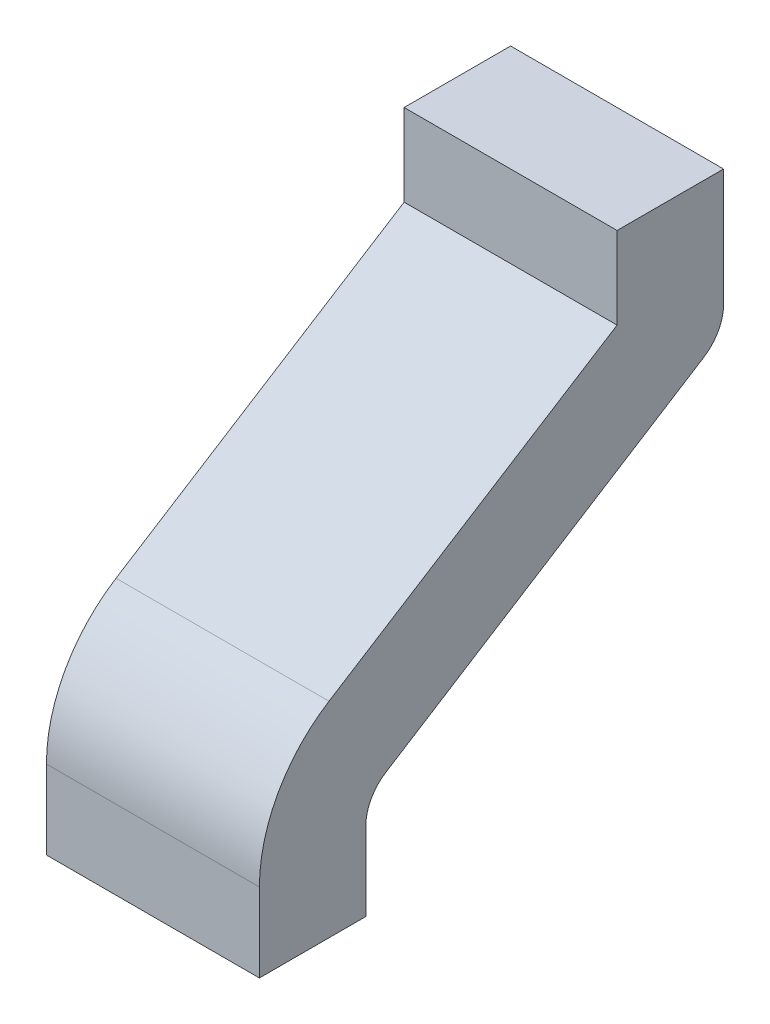
ISO-10303-21;
HEADER;
FILE_DESCRIPTION(('STEP AP214'),'2;1');
FILE_NAME('part.step','',(''),(''),'','','');
FILE_SCHEMA(('AUTOMOTIVE_DESIGN { 1 0 10303 214 1 1 1 1 }'));
ENDSEC;
DATA;
#1=APPLICATION_CONTEXT('core data for automotive mechanical design processes');
#2=APPLICATION_PROTOCOL_DEFINITION('international standard','automotive_design',2000,#1);
#3=PRODUCT_CONTEXT('',#1,'mechanical');
#4=PRODUCT('Part','Part','',(#3));
#5=PRODUCT_RELATED_PRODUCT_CATEGORY('part','',(#4));
#6=PRODUCT_DEFINITION_FORMATION('','',#4);
#7=PRODUCT_DEFINITION_CONTEXT('part definition',#1,'design');
#8=PRODUCT_DEFINITION('design','',#6,#7);
#9=PRODUCT_DEFINITION_SHAPE('','',#8);
#10=(LENGTH_UNIT() NAMED_UNIT(*) SI_UNIT(.MILLI.,.METRE.));
#11=(NAMED_UNIT(*) PLANE_ANGLE_UNIT() SI_UNIT($,.RADIAN.));
#12=(NAMED_UNIT(*) SI_UNIT($,.STERADIAN.) SOLID_ANGLE_UNIT());
#13=UNCERTAINTY_MEASURE_WITH_UNIT(LENGTH_MEASURE(1.E-05),#10,'distance_accuracy_value','');
#14=(GEOMETRIC_REPRESENTATION_CONTEXT(3) GLOBAL_UNCERTAINTY_ASSIGNED_CONTEXT((#13)) GLOBAL_UNIT_ASSIGNED_CONTEXT((#10,
#11,#12)) REPRESENTATION_CONTEXT('',''));
#15=CARTESIAN_POINT('',(0.,0.,0.));
#16=DIRECTION('',(0.,0.,1.));
#17=DIRECTION('',(1.,0.,0.));
#18=AXIS2_PLACEMENT_3D('',#15,#16,#17);
#19=CARTESIAN_POINT('',(-0.5,4.,0.650000000000007));
#20=DIRECTION('',(0.,1.,0.));
#21=DIRECTION('',(0.,0.,1.));
#22=AXIS2_PLACEMENT_3D('',#19,#20,#21);
#23=PLANE('',#22);
#24=DIRECTION('',(0.,0.,1.));
#25=VECTOR('',#24,1.);
#26=CARTESIAN_POINT('',(0.,4.,0.650000000000007));
#27=LINE('',#26,#25);
#28=CARTESIAN_POINT('',(0.,4.,0.650000000000007));
#29=VERTEX_POINT('',#28);
#30=CARTESIAN_POINT('',(0.,4.,0.900000000000007));
#31=VERTEX_POINT('',#30);
#32=EDGE_CURVE('E145',#29,#31,#27,.T.);
#33=ORIENTED_EDGE('',*,*,#32,.T.);
#34=DIRECTION('',(1.,0.,0.));
#35=VECTOR('',#34,1.);
#36=CARTESIAN_POINT('',(-0.5,4.,0.900000000000007));
#37=LINE('',#36,#35);
#38=CARTESIAN_POINT('',(-0.5,4.,0.900000000000007));
#39=VERTEX_POINT('',#38);
#40=EDGE_CURVE('E11',#39,#31,#37,.T.);
#41=ORIENTED_EDGE('',*,*,#40,.F.);
#42=DIRECTION('',(0.,0.,1.));
#43=VECTOR('',#42,1.);
#44=CARTESIAN_POINT('',(-0.5,4.,0.650000000000007));
#45=LINE('',#44,#43);
#46=CARTESIAN_POINT('',(-0.5,4.,0.650000000000007));
#47=VERTEX_POINT('',#46);
#48=EDGE_CURVE('E165',#47,#39,#45,.T.);
#49=ORIENTED_EDGE('',*,*,#48,.F.);
#50=DIRECTION('',(1.,0.,0.));
#51=VECTOR('',#50,1.);
#52=CARTESIAN_POINT('',(-0.5,4.,0.650000000000007));
#53=LINE('',#52,#51);
#54=EDGE_CURVE('E141',#47,#29,#53,.T.);
#55=ORIENTED_EDGE('',*,*,#54,.T.);
#56=EDGE_LOOP('',(#33,#41,#49,#55));
#57=FACE_BOUND('',#56,.T.);
#58=ADVANCED_FACE('F31',(#57),#23,.F.);
#59=CARTESIAN_POINT('',(-0.5,4.,0.900000000000007));
#60=DIRECTION('',(0.,0.,-1.));
#61=DIRECTION('',(-1.,0.,0.));
#62=AXIS2_PLACEMENT_3D('',#59,#60,#61);
#63=PLANE('',#62);
#64=DIRECTION('',(0.,1.,0.));
#65=VECTOR('',#64,1.);
#66=CARTESIAN_POINT('',(0.,4.,0.900000000000007));
#67=LINE('',#66,#65);
#68=CARTESIAN_POINT('',(0.,4.18501206780256,0.900000000000007));
#69=VERTEX_POINT('',#68);
#70=EDGE_CURVE('E148',#31,#69,#67,.T.);
#71=ORIENTED_EDGE('',*,*,#70,.T.);
#72=DIRECTION('',(1.,0.,0.));
#73=VECTOR('',#72,1.);
#74=CARTESIAN_POINT('',(-0.5,4.18501206780256,0.900000000000007));
#75=LINE('',#74,#73);
#76=CARTESIAN_POINT('',(-0.5,4.18501206780256,0.900000000000007));
#77=VERTEX_POINT('',#76);
#78=EDGE_CURVE('E39',#77,#69,#75,.T.);
#79=ORIENTED_EDGE('',*,*,#78,.F.);
#80=DIRECTION('',(0.,1.,0.));
#81=VECTOR('',#80,1.);
#82=CARTESIAN_POINT('',(-0.5,4.,0.900000000000007));
#83=LINE('',#82,#81);
#84=EDGE_CURVE('E99',#39,#77,#83,.T.);
#85=ORIENTED_EDGE('',*,*,#84,.F.);
#86=ORIENTED_EDGE('',*,*,#40,.T.);
#87=EDGE_LOOP('',(#71,#79,#85,#86));
#88=FACE_BOUND('',#87,.T.);
#89=ADVANCED_FACE('F237',(#88),#63,.F.);
#90=CARTESIAN_POINT('',(-0.5,4.18501206780256,0.550000000000007));
#91=DIRECTION('',(1.,0.,0.));
#92=DIRECTION('',(0.,0.,-1.));
#93=AXIS2_PLACEMENT_3D('',#90,#91,#92);
#94=CYLINDRICAL_SURFACE('',#93,0.35);
#95=CARTESIAN_POINT('',(0.,4.18501206780256,0.550000000000007));
#96=DIRECTION('',(-1.,0.,0.));
#97=DIRECTION('',(0.,0.,-1.));
#98=AXIS2_PLACEMENT_3D('',#95,#96,#97);
#99=CIRCLE('',#98,0.35);
#100=CARTESIAN_POINT('',(0.,4.48107547722632,0.736672058970754));
#101=VERTEX_POINT('',#100);
#102=EDGE_CURVE('E150',#69,#101,#99,.T.);
#103=ORIENTED_EDGE('',*,*,#102,.T.);
#104=DIRECTION('',(1.,0.,0.));
#105=VECTOR('',#104,1.);
#106=CARTESIAN_POINT('',(-0.5,4.48107547722632,0.736672058970754));
#107=LINE('',#106,#105);
#108=CARTESIAN_POINT('',(-0.5,4.48107547722632,0.736672058970754));
#109=VERTEX_POINT('',#108);
#110=EDGE_CURVE('E181',#109,#101,#107,.T.);
#111=ORIENTED_EDGE('',*,*,#110,.F.);
#112=CARTESIAN_POINT('',(-0.5,4.18501206780256,0.550000000000007));
#113=DIRECTION('',(-1.,0.,0.));
#114=DIRECTION('',(0.,0.,-1.));
#115=AXIS2_PLACEMENT_3D('',#112,#113,#114);
#116=CIRCLE('',#115,0.35);
#117=EDGE_CURVE('E189',#77,#109,#116,.T.);
#118=ORIENTED_EDGE('',*,*,#117,.F.);
#119=ORIENTED_EDGE('',*,*,#78,.T.);
#120=EDGE_LOOP('',(#103,#111,#118,#119));
#121=FACE_BOUND('',#120,.T.);
#122=ADVANCED_FACE('F187',(#121),#94,.T.);
#123=CARTESIAN_POINT('',(-0.5,4.48107547722632,0.736672058970754));
#124=DIRECTION('',(0.,-0.84589545549646,-0.533348739916424));
#125=DIRECTION('',(0.,0.533348739916424,-0.84589545549646));
#126=AXIS2_PLACEMENT_3D('',#123,#124,#125);
#127=PLANE('',#126);
#128=DIRECTION('',(0.,0.533348739916424,-0.84589545549646));
#129=VECTOR('',#128,1.);
#130=CARTESIAN_POINT('',(0.,4.48107547722632,0.736672058970754));
#131=LINE('',#130,#129);
#132=CARTESIAN_POINT('',(0.,4.90753033350446,0.0603111755521529));
#133=VERTEX_POINT('',#132);
#134=EDGE_CURVE('E152',#101,#133,#131,.T.);
#135=ORIENTED_EDGE('',*,*,#134,.T.);
#136=DIRECTION('',(1.,0.,0.));
#137=VECTOR('',#136,1.);
#138=CARTESIAN_POINT('',(-0.5,4.90753033350446,0.0603111755521529));
#139=LINE('',#138,#137);
#140=CARTESIAN_POINT('',(-0.5,4.90753033350446,0.0603111755521529));
#141=VERTEX_POINT('',#140);
#142=EDGE_CURVE('E178',#141,#133,#139,.T.);
#143=ORIENTED_EDGE('',*,*,#142,.F.);
#144=DIRECTION('',(0.,0.533348739916424,-0.84589545549646));
#145=VECTOR('',#144,1.);
#146=CARTESIAN_POINT('',(-0.5,4.48107547722632,0.736672058970754));
#147=LINE('',#146,#145);
#148=EDGE_CURVE('E207',#109,#141,#147,.T.);
#149=ORIENTED_EDGE('',*,*,#148,.F.);
#150=ORIENTED_EDGE('',*,*,#110,.T.);
#151=EDGE_LOOP('',(#135,#143,#149,#150));
#152=FACE_BOUND('',#151,.T.);
#153=ADVANCED_FACE('F198',(#152),#127,.F.);
#154=CARTESIAN_POINT('',(-0.5,4.90753033350446,0.0603111755521529));
#155=DIRECTION('',(0.,0.,-1.));
#156=DIRECTION('',(-1.,0.,0.));
#157=AXIS2_PLACEMENT_3D('',#154,#155,#156);
#158=PLANE('',#157);
#159=DIRECTION('',(0.,1.,0.));
#160=VECTOR('',#159,1.);
#161=CARTESIAN_POINT('',(0.,4.90753033350446,0.0603111755521529));
#162=LINE('',#161,#160);
#163=CARTESIAN_POINT('',(0.,5.1,0.0603111755521529));
#164=VERTEX_POINT('',#163);
#165=EDGE_CURVE('E154',#133,#164,#162,.T.);
#166=ORIENTED_EDGE('',*,*,#165,.T.);
#167=DIRECTION('',(1.,0.,0.));
#168=VECTOR('',#167,1.);
#169=CARTESIAN_POINT('',(-0.5,5.1,0.0603111755521529));
#170=LINE('',#169,#168);
#171=CARTESIAN_POINT('',(-0.5,5.1,0.0603111755521529));
#172=VERTEX_POINT('',#171);
#173=EDGE_CURVE('E175',#172,#164,#170,.T.);
#174=ORIENTED_EDGE('',*,*,#173,.F.);
#175=DIRECTION('',(0.,1.,0.));
#176=VECTOR('',#175,1.);
#177=CARTESIAN_POINT('',(-0.5,4.90753033350446,0.0603111755521529));
#178=LINE('',#177,#176);
#179=EDGE_CURVE('E204',#141,#172,#178,.T.);
#180=ORIENTED_EDGE('',*,*,#179,.F.);
#181=ORIENTED_EDGE('',*,*,#142,.T.);
#182=EDGE_LOOP('',(#166,#174,#180,#181));
#183=FACE_BOUND('',#182,.T.);
#184=ADVANCED_FACE('F202',(#183),#158,.F.);
#185=CARTESIAN_POINT('',(-0.5,5.1,-0.189688824447847));
#186=DIRECTION('',(0.,-1.,0.));
#187=DIRECTION('',(0.,0.,-1.));
#188=AXIS2_PLACEMENT_3D('',#185,#186,#187);
#189=PLANE('',#188);
#190=DIRECTION('',(0.,0.,-1.));
#191=VECTOR('',#190,1.);
#192=CARTESIAN_POINT('',(0.,5.1,-0.189688824447847));
#193=LINE('',#192,#191);
#194=CARTESIAN_POINT('',(0.,5.1,-0.189688824447847));
#195=VERTEX_POINT('',#194);
#196=EDGE_CURVE('E156',#164,#195,#193,.T.);
#197=ORIENTED_EDGE('',*,*,#196,.T.);
#198=DIRECTION('',(1.,0.,0.));
#199=VECTOR('',#198,1.);
#200=CARTESIAN_POINT('',(-0.5,5.1,-0.189688824447847));
#201=LINE('',#200,#199);
#202=CARTESIAN_POINT('',(-0.5,5.1,-0.189688824447847));
#203=VERTEX_POINT('',#202);
#204=EDGE_CURVE('E172',#203,#195,#201,.T.);
#205=ORIENTED_EDGE('',*,*,#204,.F.);
#206=DIRECTION('',(0.,0.,-1.));
#207=VECTOR('',#206,1.);
#208=CARTESIAN_POINT('',(-0.5,5.1,-0.189688824447847));
#209=LINE('',#208,#207);
#210=EDGE_CURVE('E206',#172,#203,#209,.T.);
#211=ORIENTED_EDGE('',*,*,#210,.F.);
#212=ORIENTED_EDGE('',*,*,#173,.T.);
#213=EDGE_LOOP('',(#197,#205,#211,#212));
#214=FACE_BOUND('',#213,.T.);
#215=ADVANCED_FACE('F250',(#214),#189,.F.);
#216=CARTESIAN_POINT('',(-0.5,4.82478052257014,-0.189688824447847));
#217=DIRECTION('',(0.,0.,1.));
#218=DIRECTION('',(1.,0.,0.));
#219=AXIS2_PLACEMENT_3D('',#216,#217,#218);
#220=PLANE('',#219);
#221=DIRECTION('',(0.,-1.,0.));
#222=VECTOR('',#221,1.);
#223=CARTESIAN_POINT('',(0.,4.82478052257014,-0.189688824447847));
#224=LINE('',#223,#222);
#225=CARTESIAN_POINT('',(0.,4.82478052257014,-0.189688824447847));
#226=VERTEX_POINT('',#225);
#227=EDGE_CURVE('E158',#195,#226,#224,.T.);
#228=ORIENTED_EDGE('',*,*,#227,.T.);
#229=DIRECTION('',(1.,0.,0.));
#230=VECTOR('',#229,1.);
#231=CARTESIAN_POINT('',(-0.5,4.82478052257014,-0.189688824447847));
#232=LINE('',#231,#230);
#233=CARTESIAN_POINT('',(-0.5,4.82478052257014,-0.189688824447847));
#234=VERTEX_POINT('',#233);
#235=EDGE_CURVE('E169',#234,#226,#232,.T.);
#236=ORIENTED_EDGE('',*,*,#235,.F.);
#237=DIRECTION('',(0.,-1.,0.));
#238=VECTOR('',#237,1.);
#239=CARTESIAN_POINT('',(-0.5,4.82478052257014,-0.189688824447847));
#240=LINE('',#239,#238);
#241=EDGE_CURVE('E209',#203,#234,#240,.T.);
#242=ORIENTED_EDGE('',*,*,#241,.F.);
#243=ORIENTED_EDGE('',*,*,#204,.T.);
#244=EDGE_LOOP('',(#228,#236,#242,#243));
#245=FACE_BOUND('',#244,.T.);
#246=ADVANCED_FACE('F218',(#245),#220,.F.);
#247=CARTESIAN_POINT('',(-0.5,4.82478052257013,-0.0896888244478471));
#248=DIRECTION('',(1.,0.,0.));
#249=DIRECTION('',(0.,0.,-1.));
#250=AXIS2_PLACEMENT_3D('',#247,#248,#249);
#251=CYLINDRICAL_SURFACE('',#250,0.0999999999999998);
#252=CARTESIAN_POINT('',(0.,4.82478052257013,-0.0896888244478471));
#253=DIRECTION('',(-1.,0.,0.));
#254=DIRECTION('',(0.,0.,-1.));
#255=AXIS2_PLACEMENT_3D('',#252,#253,#254);
#256=CIRCLE('',#255,0.0999999999999998);
#257=CARTESIAN_POINT('',(0.,4.74019097702049,-0.143023698439489));
#258=VERTEX_POINT('',#257);
#259=EDGE_CURVE('E160',#226,#258,#256,.T.);
#260=ORIENTED_EDGE('',*,*,#259,.T.);
#261=DIRECTION('',(1.,0.,0.));
#262=VECTOR('',#261,1.);
#263=CARTESIAN_POINT('',(-0.5,4.74019097702049,-0.143023698439489));
#264=LINE('',#263,#262);
#265=CARTESIAN_POINT('',(-0.5,4.74019097702049,-0.143023698439489));
#266=VERTEX_POINT('',#265);
#267=EDGE_CURVE('E136',#266,#258,#264,.T.);
#268=ORIENTED_EDGE('',*,*,#267,.F.);
#269=CARTESIAN_POINT('',(-0.5,4.82478052257013,-0.0896888244478471));
#270=DIRECTION('',(-1.,0.,0.));
#271=DIRECTION('',(0.,0.,-1.));
#272=AXIS2_PLACEMENT_3D('',#269,#270,#271);
#273=CIRCLE('',#272,0.0999999999999998);
#274=EDGE_CURVE('E127',#234,#266,#273,.T.);
#275=ORIENTED_EDGE('',*,*,#274,.F.);
#276=ORIENTED_EDGE('',*,*,#235,.T.);
#277=EDGE_LOOP('',(#260,#268,#275,#276));
#278=FACE_BOUND('',#277,.T.);
#279=ADVANCED_FACE('F222',(#278),#251,.T.);
#280=CARTESIAN_POINT('',(-0.5,4.26960161335221,0.603334873991649));
#281=DIRECTION('',(0.,0.845895455496459,0.533348739916424));
#282=DIRECTION('',(0.,-0.533348739916424,0.845895455496459));
#283=AXIS2_PLACEMENT_3D('',#280,#281,#282);
#284=PLANE('',#283);
#285=DIRECTION('',(0.,-0.533348739916424,0.845895455496459));
#286=VECTOR('',#285,1.);
#287=CARTESIAN_POINT('',(0.,4.26960161335221,0.603334873991649));
#288=LINE('',#287,#286);
#289=CARTESIAN_POINT('',(0.,4.26960161335221,0.603334873991649));
#290=VERTEX_POINT('',#289);
#291=EDGE_CURVE('E135',#258,#290,#288,.T.);
#292=ORIENTED_EDGE('',*,*,#291,.T.);
#293=DIRECTION('',(1.,0.,0.));
#294=VECTOR('',#293,1.);
#295=CARTESIAN_POINT('',(-0.5,4.26960161335221,0.603334873991649));
#296=LINE('',#295,#294);
#297=CARTESIAN_POINT('',(-0.5,4.26960161335221,0.603334873991649));
#298=VERTEX_POINT('',#297);
#299=EDGE_CURVE('E132',#298,#290,#296,.T.);
#300=ORIENTED_EDGE('',*,*,#299,.F.);
#301=DIRECTION('',(0.,-0.533348739916424,0.845895455496459));
#302=VECTOR('',#301,1.);
#303=CARTESIAN_POINT('',(-0.5,4.26960161335221,0.603334873991649));
#304=LINE('',#303,#302);
#305=EDGE_CURVE('E121',#266,#298,#304,.T.);
#306=ORIENTED_EDGE('',*,*,#305,.F.);
#307=ORIENTED_EDGE('',*,*,#267,.T.);
#308=EDGE_LOOP('',(#292,#300,#306,#307));
#309=FACE_BOUND('',#308,.T.);
#310=ADVANCED_FACE('F133',(#309),#284,.F.);
#311=CARTESIAN_POINT('',(-0.5,4.18501206780256,0.550000000000007));
#312=DIRECTION('',(1.,0.,0.));
#313=DIRECTION('',(0.,0.,-1.));
#314=AXIS2_PLACEMENT_3D('',#311,#312,#313);
#315=CYLINDRICAL_SURFACE('',#314,0.0999999999999998);
#316=CARTESIAN_POINT('',(0.,4.18501206780256,0.550000000000007));
#317=DIRECTION('',(1.,0.,0.));
#318=DIRECTION('',(0.,0.,-1.));
#319=AXIS2_PLACEMENT_3D('',#316,#317,#318);
#320=CIRCLE('',#319,0.0999999999999998);
#321=CARTESIAN_POINT('',(0.,4.18501206780256,0.650000000000007));
#322=VERTEX_POINT('',#321);
#323=EDGE_CURVE('E85',#290,#322,#320,.T.);
#324=ORIENTED_EDGE('',*,*,#323,.T.);
#325=DIRECTION('',(1.,0.,0.));
#326=VECTOR('',#325,1.);
#327=CARTESIAN_POINT('',(-0.5,4.18501206780256,0.650000000000007));
#328=LINE('',#327,#326);
#329=CARTESIAN_POINT('',(-0.5,4.18501206780256,0.650000000000007));
#330=VERTEX_POINT('',#329);
#331=EDGE_CURVE('E137',#330,#322,#328,.T.);
#332=ORIENTED_EDGE('',*,*,#331,.F.);
#333=CARTESIAN_POINT('',(-0.5,4.18501206780256,0.550000000000007));
#334=DIRECTION('',(1.,0.,0.));
#335=DIRECTION('',(0.,0.,-1.));
#336=AXIS2_PLACEMENT_3D('',#333,#334,#335);
#337=CIRCLE('',#336,0.0999999999999998);
#338=EDGE_CURVE('E125',#298,#330,#337,.T.);
#339=ORIENTED_EDGE('',*,*,#338,.F.);
#340=ORIENTED_EDGE('',*,*,#299,.T.);
#341=EDGE_LOOP('',(#324,#332,#339,#340));
#342=FACE_BOUND('',#341,.T.);
#343=ADVANCED_FACE('F139',(#342),#315,.F.);
#344=CARTESIAN_POINT('',(-0.5,4.,0.650000000000007));
#345=DIRECTION('',(0.,0.,1.));
#346=DIRECTION('',(1.,0.,0.));
#347=AXIS2_PLACEMENT_3D('',#344,#345,#346);
#348=PLANE('',#347);
#349=DIRECTION('',(0.,-1.,0.));
#350=VECTOR('',#349,1.);
#351=CARTESIAN_POINT('',(0.,4.,0.650000000000007));
#352=LINE('',#351,#350);
#353=EDGE_CURVE('E91',#322,#29,#352,.T.);
#354=ORIENTED_EDGE('',*,*,#353,.T.);
#355=ORIENTED_EDGE('',*,*,#54,.F.);
#356=DIRECTION('',(0.,-1.,0.));
#357=VECTOR('',#356,1.);
#358=CARTESIAN_POINT('',(-0.5,4.,0.650000000000007));
#359=LINE('',#358,#357);
#360=EDGE_CURVE('E47',#330,#47,#359,.T.);
#361=ORIENTED_EDGE('',*,*,#360,.F.);
#362=ORIENTED_EDGE('',*,*,#331,.T.);
#363=EDGE_LOOP('',(#354,#355,#361,#362));
#364=FACE_BOUND('',#363,.T.);
#365=ADVANCED_FACE('F226',(#364),#348,.F.);
#366=CARTESIAN_POINT('',(-0.5,4.18501206780256,0.550000000000007));
#367=DIRECTION('',(1.,0.,0.));
#368=DIRECTION('',(0.,0.,-1.));
#369=AXIS2_PLACEMENT_3D('',#366,#367,#368);
#370=PLANE('',#369);
#371=ORIENTED_EDGE('',*,*,#48,.T.);
#372=ORIENTED_EDGE('',*,*,#84,.T.);
#373=ORIENTED_EDGE('',*,*,#117,.T.);
#374=ORIENTED_EDGE('',*,*,#148,.T.);
#375=ORIENTED_EDGE('',*,*,#179,.T.);
#376=ORIENTED_EDGE('',*,*,#210,.T.);
#377=ORIENTED_EDGE('',*,*,#241,.T.);
#378=ORIENTED_EDGE('',*,*,#274,.T.);
#379=ORIENTED_EDGE('',*,*,#305,.T.);
#380=ORIENTED_EDGE('',*,*,#338,.T.);
#381=ORIENTED_EDGE('',*,*,#360,.T.);
#382=EDGE_LOOP('',(#371,#372,#373,#374,#375,#376,#377,#378,#379,#380,#381));
#383=FACE_BOUND('',#382,.T.);
#384=ADVANCED_FACE('F123',(#383),#370,.F.);
#385=CARTESIAN_POINT('',(0.,4.18501206780256,0.550000000000007));
#386=DIRECTION('',(1.,0.,0.));
#387=DIRECTION('',(0.,0.,-1.));
#388=AXIS2_PLACEMENT_3D('',#385,#386,#387);
#389=PLANE('',#388);
#390=ORIENTED_EDGE('',*,*,#32,.F.);
#391=ORIENTED_EDGE('',*,*,#353,.F.);
#392=ORIENTED_EDGE('',*,*,#323,.F.);
#393=ORIENTED_EDGE('',*,*,#291,.F.);
#394=ORIENTED_EDGE('',*,*,#259,.F.);
#395=ORIENTED_EDGE('',*,*,#227,.F.);
#396=ORIENTED_EDGE('',*,*,#196,.F.);
#397=ORIENTED_EDGE('',*,*,#165,.F.);
#398=ORIENTED_EDGE('',*,*,#134,.F.);
#399=ORIENTED_EDGE('',*,*,#102,.F.);
#400=ORIENTED_EDGE('',*,*,#70,.F.);
#401=EDGE_LOOP('',(#390,#391,#392,#393,#394,#395,#396,#397,#398,#399,#400));
#402=FACE_BOUND('',#401,.T.);
#403=ADVANCED_FACE('F193',(#402),#389,.T.);
#404=CLOSED_SHELL('',(#58,#89,#122,#153,#184,#215,#246,#279,#310,#343,#365,#384,#403));
#405=MANIFOLD_SOLID_BREP('B2',#404);
#406=ADVANCED_BREP_SHAPE_REPRESENTATION('',(#18,#405),#14);
#407=SHAPE_DEFINITION_REPRESENTATION(#9,#406);
ENDSEC;
END-ISO-10303-21;
